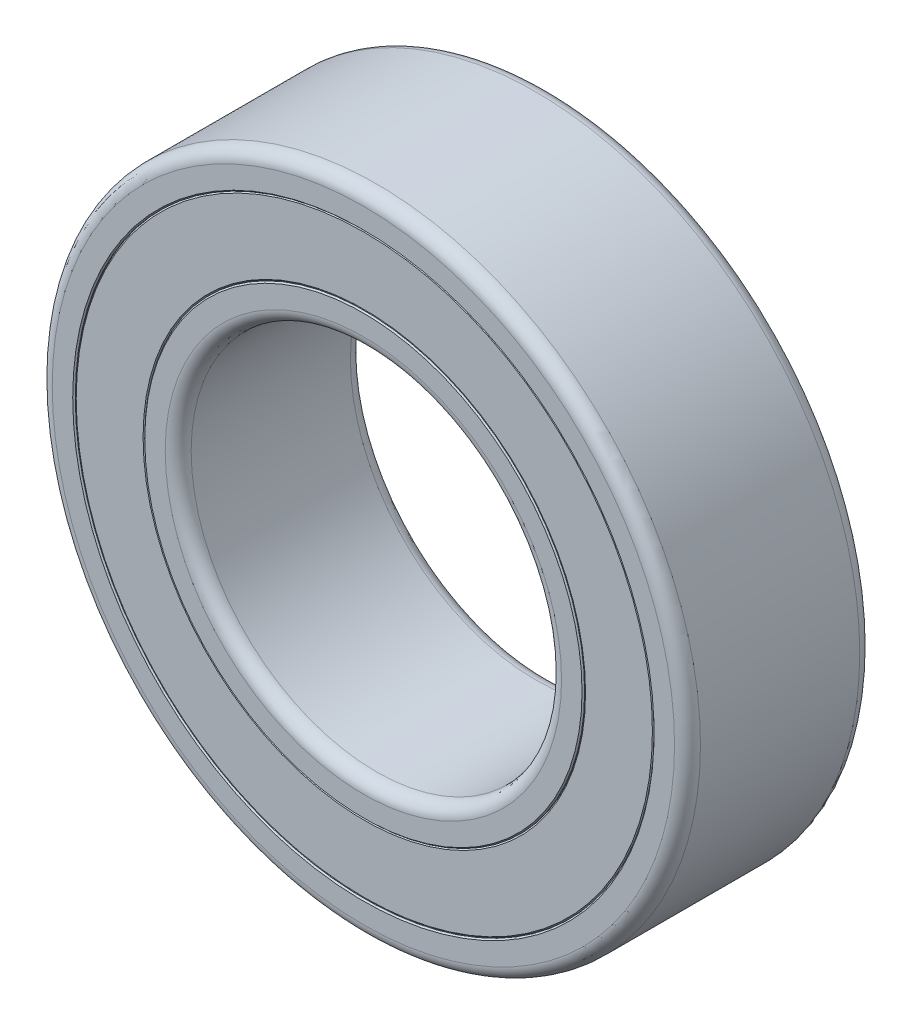
ISO-10303-21;
HEADER;
FILE_DESCRIPTION(('STEP AP214'),'2;1');
FILE_NAME('part.step','',(''),(''),'','','');
FILE_SCHEMA(('AUTOMOTIVE_DESIGN { 1 0 10303 214 1 1 1 1 }'));
ENDSEC;
DATA;
#1=APPLICATION_CONTEXT('core data for automotive mechanical design processes');
#2=APPLICATION_PROTOCOL_DEFINITION('international standard','automotive_design',2000,#1);
#3=PRODUCT_CONTEXT('',#1,'mechanical');
#4=PRODUCT('Part','Part','',(#3));
#5=PRODUCT_RELATED_PRODUCT_CATEGORY('part','',(#4));
#6=PRODUCT_DEFINITION_FORMATION('','',#4);
#7=PRODUCT_DEFINITION_CONTEXT('part definition',#1,'design');
#8=PRODUCT_DEFINITION('design','',#6,#7);
#9=PRODUCT_DEFINITION_SHAPE('','',#8);
#10=(LENGTH_UNIT() NAMED_UNIT(*) SI_UNIT(.MILLI.,.METRE.));
#11=(NAMED_UNIT(*) PLANE_ANGLE_UNIT() SI_UNIT($,.RADIAN.));
#12=(NAMED_UNIT(*) SI_UNIT($,.STERADIAN.) SOLID_ANGLE_UNIT());
#13=UNCERTAINTY_MEASURE_WITH_UNIT(LENGTH_MEASURE(1.E-05),#10,'distance_accuracy_value','');
#14=(GEOMETRIC_REPRESENTATION_CONTEXT(3) GLOBAL_UNCERTAINTY_ASSIGNED_CONTEXT((#13)) GLOBAL_UNIT_ASSIGNED_CONTEXT((#10,
#11,#12)) REPRESENTATION_CONTEXT('',''));
#15=CARTESIAN_POINT('',(0.,0.,0.));
#16=DIRECTION('',(0.,0.,1.));
#17=DIRECTION('',(1.,0.,0.));
#18=AXIS2_PLACEMENT_3D('',#15,#16,#17);
#19=CARTESIAN_POINT('',(0.,6.25,-1.98));
#20=DIRECTION('',(0.,0.,1.));
#21=DIRECTION('',(1.,0.,0.));
#22=AXIS2_PLACEMENT_3D('',#19,#20,#21);
#23=PLANE('',#22);
#24=CARTESIAN_POINT('',(0.,0.,-1.98));
#25=DIRECTION('',(0.,0.,1.));
#26=DIRECTION('',(1.,0.,0.));
#27=AXIS2_PLACEMENT_3D('',#24,#25,#26);
#28=CIRCLE('',#27,4.778);
#29=CARTESIAN_POINT('',(4.778,0.,-1.98));
#30=VERTEX_POINT('',#29);
#31=EDGE_CURVE('E89',#30,#30,#28,.T.);
#32=ORIENTED_EDGE('',*,*,#31,.T.);
#33=EDGE_LOOP('',(#32));
#34=FACE_BOUND('',#33,.T.);
#35=CARTESIAN_POINT('',(0.,0.,-1.98));
#36=DIRECTION('',(0.,0.,1.));
#37=DIRECTION('',(1.,0.,0.));
#38=AXIS2_PLACEMENT_3D('',#35,#36,#37);
#39=CIRCLE('',#38,6.222);
#40=CARTESIAN_POINT('',(6.222,0.,-1.98));
#41=VERTEX_POINT('',#40);
#42=EDGE_CURVE('E93',#41,#41,#39,.F.);
#43=ORIENTED_EDGE('',*,*,#42,.T.);
#44=EDGE_LOOP('',(#43));
#45=FACE_BOUND('',#44,.T.);
#46=ADVANCED_FACE('F56',(#34,#45),#23,.F.);
#47=CARTESIAN_POINT('',(0.,0.,17.5));
#48=DIRECTION('',(0.,0.,1.));
#49=DIRECTION('',(1.,0.,0.));
#50=AXIS2_PLACEMENT_3D('',#47,#48,#49);
#51=CYLINDRICAL_SURFACE('',#50,6.25);
#52=CARTESIAN_POINT('',(0.,0.,-1.952));
#53=DIRECTION('',(0.,0.,1.));
#54=DIRECTION('',(1.,0.,0.));
#55=AXIS2_PLACEMENT_3D('',#52,#53,#54);
#56=CIRCLE('',#55,6.25);
#57=CARTESIAN_POINT('',(6.25,0.,-1.952));
#58=VERTEX_POINT('',#57);
#59=EDGE_CURVE('E71',#58,#58,#56,.T.);
#60=ORIENTED_EDGE('',*,*,#59,.T.);
#61=EDGE_LOOP('',(#60));
#62=FACE_BOUND('',#61,.T.);
#63=CARTESIAN_POINT('',(0.,0.,1.952));
#64=DIRECTION('',(0.,0.,-1.));
#65=DIRECTION('',(-1.,0.,0.));
#66=AXIS2_PLACEMENT_3D('',#63,#64,#65);
#67=CIRCLE('',#66,6.25);
#68=CARTESIAN_POINT('',(-6.25,0.,1.952));
#69=VERTEX_POINT('',#68);
#70=EDGE_CURVE('E76',#69,#69,#67,.T.);
#71=ORIENTED_EDGE('',*,*,#70,.T.);
#72=EDGE_LOOP('',(#71));
#73=FACE_BOUND('',#72,.T.);
#74=ADVANCED_FACE('F107',(#62,#73),#51,.T.);
#75=CARTESIAN_POINT('',(0.,6.25,1.98));
#76=DIRECTION('',(0.,0.,-1.));
#77=DIRECTION('',(-1.,0.,0.));
#78=AXIS2_PLACEMENT_3D('',#75,#76,#77);
#79=PLANE('',#78);
#80=CARTESIAN_POINT('',(0.,0.,1.98));
#81=DIRECTION('',(0.,0.,-1.));
#82=DIRECTION('',(-1.,0.,0.));
#83=AXIS2_PLACEMENT_3D('',#80,#81,#82);
#84=CIRCLE('',#83,6.222);
#85=CARTESIAN_POINT('',(-6.222,0.,1.98));
#86=VERTEX_POINT('',#85);
#87=EDGE_CURVE('E11',#86,#86,#84,.F.);
#88=ORIENTED_EDGE('',*,*,#87,.T.);
#89=EDGE_LOOP('',(#88));
#90=FACE_BOUND('',#89,.T.);
#91=CARTESIAN_POINT('',(0.,0.,1.98));
#92=DIRECTION('',(0.,0.,-1.));
#93=DIRECTION('',(-1.,0.,0.));
#94=AXIS2_PLACEMENT_3D('',#91,#92,#93);
#95=CIRCLE('',#94,4.778);
#96=CARTESIAN_POINT('',(-4.778,0.,1.98));
#97=VERTEX_POINT('',#96);
#98=EDGE_CURVE('E65',#97,#97,#95,.T.);
#99=ORIENTED_EDGE('',*,*,#98,.T.);
#100=EDGE_LOOP('',(#99));
#101=FACE_BOUND('',#100,.T.);
#102=ADVANCED_FACE('F110',(#90,#101),#79,.F.);
#103=CARTESIAN_POINT('',(0.,0.,17.5));
#104=DIRECTION('',(0.,0.,1.));
#105=DIRECTION('',(1.,0.,0.));
#106=AXIS2_PLACEMENT_3D('',#103,#104,#105);
#107=CYLINDRICAL_SURFACE('',#106,4.75);
#108=CARTESIAN_POINT('',(0.,0.,-1.952));
#109=DIRECTION('',(0.,0.,1.));
#110=DIRECTION('',(1.,0.,0.));
#111=AXIS2_PLACEMENT_3D('',#108,#109,#110);
#112=CIRCLE('',#111,4.75);
#113=CARTESIAN_POINT('',(4.75,0.,-1.952));
#114=VERTEX_POINT('',#113);
#115=EDGE_CURVE('E81',#114,#114,#112,.F.);
#116=ORIENTED_EDGE('',*,*,#115,.T.);
#117=EDGE_LOOP('',(#116));
#118=FACE_BOUND('',#117,.T.);
#119=CARTESIAN_POINT('',(0.,0.,1.952));
#120=DIRECTION('',(0.,0.,-1.));
#121=DIRECTION('',(-1.,0.,0.));
#122=AXIS2_PLACEMENT_3D('',#119,#120,#121);
#123=CIRCLE('',#122,4.75);
#124=CARTESIAN_POINT('',(-4.75,0.,1.952));
#125=VERTEX_POINT('',#124);
#126=EDGE_CURVE('E85',#125,#125,#123,.F.);
#127=ORIENTED_EDGE('',*,*,#126,.T.);
#128=EDGE_LOOP('',(#127));
#129=FACE_BOUND('',#128,.T.);
#130=ADVANCED_FACE('F132',(#118,#129),#107,.F.);
#131=CARTESIAN_POINT('',(0.,0.,-1.98));
#132=DIRECTION('',(0.,0.,-1.));
#133=DIRECTION('',(-1.,0.,0.));
#134=AXIS2_PLACEMENT_3D('',#131,#132,#133);
#135=CONICAL_SURFACE('',#134,4.778,0.785398163397448);
#136=ORIENTED_EDGE('',*,*,#115,.F.);
#137=EDGE_LOOP('',(#136));
#138=FACE_BOUND('',#137,.T.);
#139=ORIENTED_EDGE('',*,*,#31,.F.);
#140=EDGE_LOOP('',(#139));
#141=FACE_BOUND('',#140,.T.);
#142=ADVANCED_FACE('F103',(#138,#141),#135,.F.);
#143=CARTESIAN_POINT('',(0.,0.,-1.952));
#144=DIRECTION('',(0.,0.,1.));
#145=DIRECTION('',(1.,0.,0.));
#146=AXIS2_PLACEMENT_3D('',#143,#144,#145);
#147=CONICAL_SURFACE('',#146,6.25,0.785398163397448);
#148=ORIENTED_EDGE('',*,*,#42,.F.);
#149=EDGE_LOOP('',(#148));
#150=FACE_BOUND('',#149,.T.);
#151=ORIENTED_EDGE('',*,*,#59,.F.);
#152=EDGE_LOOP('',(#151));
#153=FACE_BOUND('',#152,.T.);
#154=ADVANCED_FACE('F99',(#150,#153),#147,.T.);
#155=CARTESIAN_POINT('',(0.,0.,1.98));
#156=DIRECTION('',(0.,0.,-1.));
#157=DIRECTION('',(-1.,0.,0.));
#158=AXIS2_PLACEMENT_3D('',#155,#156,#157);
#159=CONICAL_SURFACE('',#158,6.222,0.785398163397402);
#160=ORIENTED_EDGE('',*,*,#70,.F.);
#161=EDGE_LOOP('',(#160));
#162=FACE_BOUND('',#161,.T.);
#163=ORIENTED_EDGE('',*,*,#87,.F.);
#164=EDGE_LOOP('',(#163));
#165=FACE_BOUND('',#164,.T.);
#166=ADVANCED_FACE('F102',(#162,#165),#159,.T.);
#167=CARTESIAN_POINT('',(0.,0.,1.952));
#168=DIRECTION('',(0.,0.,1.));
#169=DIRECTION('',(1.,0.,0.));
#170=AXIS2_PLACEMENT_3D('',#167,#168,#169);
#171=CONICAL_SURFACE('',#170,4.75,0.785398163397417);
#172=ORIENTED_EDGE('',*,*,#98,.F.);
#173=EDGE_LOOP('',(#172));
#174=FACE_BOUND('',#173,.T.);
#175=ORIENTED_EDGE('',*,*,#126,.F.);
#176=EDGE_LOOP('',(#175));
#177=FACE_BOUND('',#176,.T.);
#178=ADVANCED_FACE('F59',(#174,#177),#171,.F.);
#179=CLOSED_SHELL('',(#46,#74,#102,#130,#142,#154,#166,#178));
#180=MANIFOLD_SOLID_BREP('B2',#179);
#181=CARTESIAN_POINT('',(0.,7.,-2.));
#182=DIRECTION('',(0.,0.,1.));
#183=DIRECTION('',(1.,0.,0.));
#184=AXIS2_PLACEMENT_3D('',#181,#182,#183);
#185=PLANE('',#184);
#186=CARTESIAN_POINT('',(0.,0.,-2.));
#187=DIRECTION('',(0.,0.,1.));
#188=DIRECTION('',(1.,0.,0.));
#189=AXIS2_PLACEMENT_3D('',#186,#187,#188);
#190=CIRCLE('',#189,6.278);
#191=CARTESIAN_POINT('',(6.278,0.,-2.));
#192=VERTEX_POINT('',#191);
#193=EDGE_CURVE('E55',#192,#192,#190,.T.);
#194=ORIENTED_EDGE('',*,*,#193,.T.);
#195=EDGE_LOOP('',(#194));
#196=FACE_BOUND('',#195,.T.);
#197=CARTESIAN_POINT('',(0.,0.,-2.));
#198=DIRECTION('',(0.,0.,1.));
#199=DIRECTION('',(1.,0.,0.));
#200=AXIS2_PLACEMENT_3D('',#197,#198,#199);
#201=CIRCLE('',#200,6.72);
#202=CARTESIAN_POINT('',(6.72,0.,-2.));
#203=VERTEX_POINT('',#202);
#204=EDGE_CURVE('E260',#203,#203,#201,.F.);
#205=ORIENTED_EDGE('',*,*,#204,.T.);
#206=EDGE_LOOP('',(#205));
#207=FACE_BOUND('',#206,.T.);
#208=ADVANCED_FACE('F229',(#196,#207),#185,.F.);
#209=CARTESIAN_POINT('',(0.,0.,17.5));
#210=DIRECTION('',(0.,0.,1.));
#211=DIRECTION('',(1.,0.,0.));
#212=AXIS2_PLACEMENT_3D('',#209,#210,#211);
#213=CYLINDRICAL_SURFACE('',#212,7.);
#214=CARTESIAN_POINT('',(0.,0.,-1.72));
#215=DIRECTION('',(0.,0.,1.));
#216=DIRECTION('',(1.,0.,0.));
#217=AXIS2_PLACEMENT_3D('',#214,#215,#216);
#218=CIRCLE('',#217,7.);
#219=CARTESIAN_POINT('',(7.,0.,-1.72));
#220=VERTEX_POINT('',#219);
#221=EDGE_CURVE('E263',#220,#220,#218,.T.);
#222=ORIENTED_EDGE('',*,*,#221,.T.);
#223=EDGE_LOOP('',(#222));
#224=FACE_BOUND('',#223,.T.);
#225=CARTESIAN_POINT('',(0.,0.,1.72));
#226=DIRECTION('',(0.,0.,-1.));
#227=DIRECTION('',(-1.,0.,0.));
#228=AXIS2_PLACEMENT_3D('',#225,#226,#227);
#229=CIRCLE('',#228,7.);
#230=CARTESIAN_POINT('',(-7.,0.,1.72));
#231=VERTEX_POINT('',#230);
#232=EDGE_CURVE('E266',#231,#231,#229,.T.);
#233=ORIENTED_EDGE('',*,*,#232,.T.);
#234=EDGE_LOOP('',(#233));
#235=FACE_BOUND('',#234,.T.);
#236=ADVANCED_FACE('F271',(#224,#235),#213,.T.);
#237=CARTESIAN_POINT('',(0.,7.,2.));
#238=DIRECTION('',(0.,0.,-1.));
#239=DIRECTION('',(-1.,0.,0.));
#240=AXIS2_PLACEMENT_3D('',#237,#238,#239);
#241=PLANE('',#240);
#242=CARTESIAN_POINT('',(0.,0.,2.));
#243=DIRECTION('',(0.,0.,-1.));
#244=DIRECTION('',(-1.,0.,0.));
#245=AXIS2_PLACEMENT_3D('',#242,#243,#244);
#246=CIRCLE('',#245,6.278);
#247=CARTESIAN_POINT('',(-6.278,0.,2.));
#248=VERTEX_POINT('',#247);
#249=EDGE_CURVE('E238',#248,#248,#246,.T.);
#250=ORIENTED_EDGE('',*,*,#249,.T.);
#251=EDGE_LOOP('',(#250));
#252=FACE_BOUND('',#251,.T.);
#253=CARTESIAN_POINT('',(0.,0.,2.));
#254=DIRECTION('',(0.,0.,-1.));
#255=DIRECTION('',(-1.,0.,0.));
#256=AXIS2_PLACEMENT_3D('',#253,#254,#255);
#257=CIRCLE('',#256,6.72);
#258=CARTESIAN_POINT('',(-6.72,0.,2.));
#259=VERTEX_POINT('',#258);
#260=EDGE_CURVE('E257',#259,#259,#257,.F.);
#261=ORIENTED_EDGE('',*,*,#260,.T.);
#262=EDGE_LOOP('',(#261));
#263=FACE_BOUND('',#262,.T.);
#264=ADVANCED_FACE('F281',(#252,#263),#241,.F.);
#265=CARTESIAN_POINT('',(0.,0.,17.5));
#266=DIRECTION('',(0.,0.,1.));
#267=DIRECTION('',(1.,0.,0.));
#268=AXIS2_PLACEMENT_3D('',#265,#266,#267);
#269=CYLINDRICAL_SURFACE('',#268,6.25);
#270=CARTESIAN_POINT('',(0.,0.,1.972));
#271=DIRECTION('',(0.,0.,-1.));
#272=DIRECTION('',(-1.,0.,0.));
#273=AXIS2_PLACEMENT_3D('',#270,#271,#272);
#274=CIRCLE('',#273,6.25);
#275=CARTESIAN_POINT('',(-6.25,0.,1.972));
#276=VERTEX_POINT('',#275);
#277=EDGE_CURVE('E245',#276,#276,#274,.F.);
#278=ORIENTED_EDGE('',*,*,#277,.T.);
#279=EDGE_LOOP('',(#278));
#280=FACE_BOUND('',#279,.T.);
#281=CARTESIAN_POINT('',(0.,0.,-1.97199999999999));
#282=DIRECTION('',(0.,0.,1.));
#283=DIRECTION('',(1.,0.,0.));
#284=AXIS2_PLACEMENT_3D('',#281,#282,#283);
#285=CIRCLE('',#284,6.25);
#286=CARTESIAN_POINT('',(6.25,0.,-1.97199999999999));
#287=VERTEX_POINT('',#286);
#288=EDGE_CURVE('E251',#287,#287,#285,.F.);
#289=ORIENTED_EDGE('',*,*,#288,.T.);
#290=EDGE_LOOP('',(#289));
#291=FACE_BOUND('',#290,.T.);
#292=ADVANCED_FACE('F283',(#280,#291),#269,.F.);
#293=CARTESIAN_POINT('',(0.,0.,-1.72));
#294=DIRECTION('',(0.,0.,1.));
#295=DIRECTION('',(1.,0.,0.));
#296=AXIS2_PLACEMENT_3D('',#293,#294,#295);
#297=TOROIDAL_SURFACE('',#296,6.72,0.28);
#298=ORIENTED_EDGE('',*,*,#204,.F.);
#299=EDGE_LOOP('',(#298));
#300=FACE_BOUND('',#299,.T.);
#301=ORIENTED_EDGE('',*,*,#221,.F.);
#302=EDGE_LOOP('',(#301));
#303=FACE_BOUND('',#302,.T.);
#304=ADVANCED_FACE('F277',(#300,#303),#297,.T.);
#305=CARTESIAN_POINT('',(0.,0.,1.72));
#306=DIRECTION('',(0.,0.,-1.));
#307=DIRECTION('',(-1.,0.,0.));
#308=AXIS2_PLACEMENT_3D('',#305,#306,#307);
#309=TOROIDAL_SURFACE('',#308,6.72,0.28);
#310=ORIENTED_EDGE('',*,*,#232,.F.);
#311=EDGE_LOOP('',(#310));
#312=FACE_BOUND('',#311,.T.);
#313=ORIENTED_EDGE('',*,*,#260,.F.);
#314=EDGE_LOOP('',(#313));
#315=FACE_BOUND('',#314,.T.);
#316=ADVANCED_FACE('F273',(#312,#315),#309,.T.);
#317=CARTESIAN_POINT('',(0.,0.,1.972));
#318=DIRECTION('',(0.,0.,1.));
#319=DIRECTION('',(1.,0.,0.));
#320=AXIS2_PLACEMENT_3D('',#317,#318,#319);
#321=CONICAL_SURFACE('',#320,6.25,0.785398163397495);
#322=ORIENTED_EDGE('',*,*,#249,.F.);
#323=EDGE_LOOP('',(#322));
#324=FACE_BOUND('',#323,.T.);
#325=ORIENTED_EDGE('',*,*,#277,.F.);
#326=EDGE_LOOP('',(#325));
#327=FACE_BOUND('',#326,.T.);
#328=ADVANCED_FACE('F276',(#324,#327),#321,.F.);
#329=CARTESIAN_POINT('',(0.,0.,-2.));
#330=DIRECTION('',(0.,0.,-1.));
#331=DIRECTION('',(-1.,0.,0.));
#332=AXIS2_PLACEMENT_3D('',#329,#330,#331);
#333=CONICAL_SURFACE('',#332,6.278,0.785398163397371);
#334=ORIENTED_EDGE('',*,*,#288,.F.);
#335=EDGE_LOOP('',(#334));
#336=FACE_BOUND('',#335,.T.);
#337=ORIENTED_EDGE('',*,*,#193,.F.);
#338=EDGE_LOOP('',(#337));
#339=FACE_BOUND('',#338,.T.);
#340=ADVANCED_FACE('F232',(#336,#339),#333,.F.);
#341=CLOSED_SHELL('',(#208,#236,#264,#292,#304,#316,#328,#340));
#342=MANIFOLD_SOLID_BREP('B6',#341);
#343=CARTESIAN_POINT('',(0.,4.75,2.));
#344=DIRECTION('',(0.,0.,-1.));
#345=DIRECTION('',(-1.,0.,0.));
#346=AXIS2_PLACEMENT_3D('',#343,#344,#345);
#347=PLANE('',#346);
#348=CARTESIAN_POINT('',(0.,0.,2.));
#349=DIRECTION('',(0.,0.,-1.));
#350=DIRECTION('',(-1.,0.,0.));
#351=AXIS2_PLACEMENT_3D('',#348,#349,#350);
#352=CIRCLE('',#351,4.722);
#353=CARTESIAN_POINT('',(-4.722,0.,2.));
#354=VERTEX_POINT('',#353);
#355=EDGE_CURVE('E228',#354,#354,#352,.F.);
#356=ORIENTED_EDGE('',*,*,#355,.T.);
#357=EDGE_LOOP('',(#356));
#358=FACE_BOUND('',#357,.T.);
#359=CARTESIAN_POINT('',(0.,0.,2.));
#360=DIRECTION('',(0.,0.,-1.));
#361=DIRECTION('',(-1.,0.,0.));
#362=AXIS2_PLACEMENT_3D('',#359,#360,#361);
#363=CIRCLE('',#362,4.28);
#364=CARTESIAN_POINT('',(-4.28,0.,2.));
#365=VERTEX_POINT('',#364);
#366=EDGE_CURVE('E404',#365,#365,#363,.T.);
#367=ORIENTED_EDGE('',*,*,#366,.T.);
#368=EDGE_LOOP('',(#367));
#369=FACE_BOUND('',#368,.T.);
#370=ADVANCED_FACE('F373',(#358,#369),#347,.F.);
#371=CARTESIAN_POINT('',(0.,0.,17.5));
#372=DIRECTION('',(0.,0.,1.));
#373=DIRECTION('',(1.,0.,0.));
#374=AXIS2_PLACEMENT_3D('',#371,#372,#373);
#375=CYLINDRICAL_SURFACE('',#374,4.);
#376=CARTESIAN_POINT('',(0.,0.,1.72));
#377=DIRECTION('',(0.,0.,-1.));
#378=DIRECTION('',(-1.,0.,0.));
#379=AXIS2_PLACEMENT_3D('',#376,#377,#378);
#380=CIRCLE('',#379,4.);
#381=CARTESIAN_POINT('',(-4.,0.,1.72));
#382=VERTEX_POINT('',#381);
#383=EDGE_CURVE('E407',#382,#382,#380,.F.);
#384=ORIENTED_EDGE('',*,*,#383,.T.);
#385=EDGE_LOOP('',(#384));
#386=FACE_BOUND('',#385,.T.);
#387=CARTESIAN_POINT('',(0.,0.,-1.72));
#388=DIRECTION('',(0.,0.,1.));
#389=DIRECTION('',(1.,0.,0.));
#390=AXIS2_PLACEMENT_3D('',#387,#388,#389);
#391=CIRCLE('',#390,4.);
#392=CARTESIAN_POINT('',(4.,0.,-1.72));
#393=VERTEX_POINT('',#392);
#394=EDGE_CURVE('E411',#393,#393,#391,.F.);
#395=ORIENTED_EDGE('',*,*,#394,.T.);
#396=EDGE_LOOP('',(#395));
#397=FACE_BOUND('',#396,.T.);
#398=ADVANCED_FACE('F415',(#386,#397),#375,.F.);
#399=CARTESIAN_POINT('',(0.,4.75,-2.));
#400=DIRECTION('',(0.,0.,1.));
#401=DIRECTION('',(1.,0.,0.));
#402=AXIS2_PLACEMENT_3D('',#399,#400,#401);
#403=PLANE('',#402);
#404=CARTESIAN_POINT('',(0.,0.,-2.));
#405=DIRECTION('',(0.,0.,1.));
#406=DIRECTION('',(1.,0.,0.));
#407=AXIS2_PLACEMENT_3D('',#404,#405,#406);
#408=CIRCLE('',#407,4.722);
#409=CARTESIAN_POINT('',(4.722,0.,-2.));
#410=VERTEX_POINT('',#409);
#411=EDGE_CURVE('E382',#410,#410,#408,.F.);
#412=ORIENTED_EDGE('',*,*,#411,.T.);
#413=EDGE_LOOP('',(#412));
#414=FACE_BOUND('',#413,.T.);
#415=CARTESIAN_POINT('',(0.,0.,-2.));
#416=DIRECTION('',(0.,0.,1.));
#417=DIRECTION('',(1.,0.,0.));
#418=AXIS2_PLACEMENT_3D('',#415,#416,#417);
#419=CIRCLE('',#418,4.28);
#420=CARTESIAN_POINT('',(4.28,0.,-2.));
#421=VERTEX_POINT('',#420);
#422=EDGE_CURVE('E400',#421,#421,#419,.T.);
#423=ORIENTED_EDGE('',*,*,#422,.T.);
#424=EDGE_LOOP('',(#423));
#425=FACE_BOUND('',#424,.T.);
#426=ADVANCED_FACE('F425',(#414,#425),#403,.F.);
#427=CARTESIAN_POINT('',(0.,0.,17.5));
#428=DIRECTION('',(0.,0.,1.));
#429=DIRECTION('',(1.,0.,0.));
#430=AXIS2_PLACEMENT_3D('',#427,#428,#429);
#431=CYLINDRICAL_SURFACE('',#430,4.75);
#432=CARTESIAN_POINT('',(0.,0.,-1.972));
#433=DIRECTION('',(0.,0.,1.));
#434=DIRECTION('',(1.,0.,0.));
#435=AXIS2_PLACEMENT_3D('',#432,#433,#434);
#436=CIRCLE('',#435,4.75);
#437=CARTESIAN_POINT('',(4.75,0.,-1.972));
#438=VERTEX_POINT('',#437);
#439=EDGE_CURVE('E389',#438,#438,#436,.T.);
#440=ORIENTED_EDGE('',*,*,#439,.T.);
#441=EDGE_LOOP('',(#440));
#442=FACE_BOUND('',#441,.T.);
#443=CARTESIAN_POINT('',(0.,0.,1.972));
#444=DIRECTION('',(0.,0.,-1.));
#445=DIRECTION('',(-1.,0.,0.));
#446=AXIS2_PLACEMENT_3D('',#443,#444,#445);
#447=CIRCLE('',#446,4.75);
#448=CARTESIAN_POINT('',(-4.75,0.,1.972));
#449=VERTEX_POINT('',#448);
#450=EDGE_CURVE('E395',#449,#449,#447,.T.);
#451=ORIENTED_EDGE('',*,*,#450,.T.);
#452=EDGE_LOOP('',(#451));
#453=FACE_BOUND('',#452,.T.);
#454=ADVANCED_FACE('F427',(#442,#453),#431,.T.);
#455=CARTESIAN_POINT('',(0.,0.,1.72));
#456=DIRECTION('',(0.,0.,-1.));
#457=DIRECTION('',(-1.,0.,0.));
#458=AXIS2_PLACEMENT_3D('',#455,#456,#457);
#459=TOROIDAL_SURFACE('',#458,4.28,0.28);
#460=ORIENTED_EDGE('',*,*,#366,.F.);
#461=EDGE_LOOP('',(#460));
#462=FACE_BOUND('',#461,.T.);
#463=ORIENTED_EDGE('',*,*,#383,.F.);
#464=EDGE_LOOP('',(#463));
#465=FACE_BOUND('',#464,.T.);
#466=ADVANCED_FACE('F421',(#462,#465),#459,.T.);
#467=CARTESIAN_POINT('',(0.,0.,-1.72));
#468=DIRECTION('',(0.,0.,1.));
#469=DIRECTION('',(1.,0.,0.));
#470=AXIS2_PLACEMENT_3D('',#467,#468,#469);
#471=TOROIDAL_SURFACE('',#470,4.28,0.28);
#472=ORIENTED_EDGE('',*,*,#394,.F.);
#473=EDGE_LOOP('',(#472));
#474=FACE_BOUND('',#473,.T.);
#475=ORIENTED_EDGE('',*,*,#422,.F.);
#476=EDGE_LOOP('',(#475));
#477=FACE_BOUND('',#476,.T.);
#478=ADVANCED_FACE('F417',(#474,#477),#471,.T.);
#479=CARTESIAN_POINT('',(0.,0.,-1.972));
#480=DIRECTION('',(0.,0.,1.));
#481=DIRECTION('',(1.,0.,0.));
#482=AXIS2_PLACEMENT_3D('',#479,#480,#481);
#483=CONICAL_SURFACE('',#482,4.75,0.785398163397417);
#484=ORIENTED_EDGE('',*,*,#411,.F.);
#485=EDGE_LOOP('',(#484));
#486=FACE_BOUND('',#485,.T.);
#487=ORIENTED_EDGE('',*,*,#439,.F.);
#488=EDGE_LOOP('',(#487));
#489=FACE_BOUND('',#488,.T.);
#490=ADVANCED_FACE('F420',(#486,#489),#483,.T.);
#491=CARTESIAN_POINT('',(0.,0.,2.));
#492=DIRECTION('',(0.,0.,-1.));
#493=DIRECTION('',(-1.,0.,0.));
#494=AXIS2_PLACEMENT_3D('',#491,#492,#493);
#495=CONICAL_SURFACE('',#494,4.722,0.785398163397479);
#496=ORIENTED_EDGE('',*,*,#450,.F.);
#497=EDGE_LOOP('',(#496));
#498=FACE_BOUND('',#497,.T.);
#499=ORIENTED_EDGE('',*,*,#355,.F.);
#500=EDGE_LOOP('',(#499));
#501=FACE_BOUND('',#500,.T.);
#502=ADVANCED_FACE('F376',(#498,#501),#495,.T.);
#503=CLOSED_SHELL('',(#370,#398,#426,#454,#466,#478,#490,#502));
#504=MANIFOLD_SOLID_BREP('B50',#503);
#505=ADVANCED_BREP_SHAPE_REPRESENTATION('',(#18,#180,#342,#504),#14);
#506=SHAPE_DEFINITION_REPRESENTATION(#9,#505);
ENDSEC;
END-ISO-10303-21;
